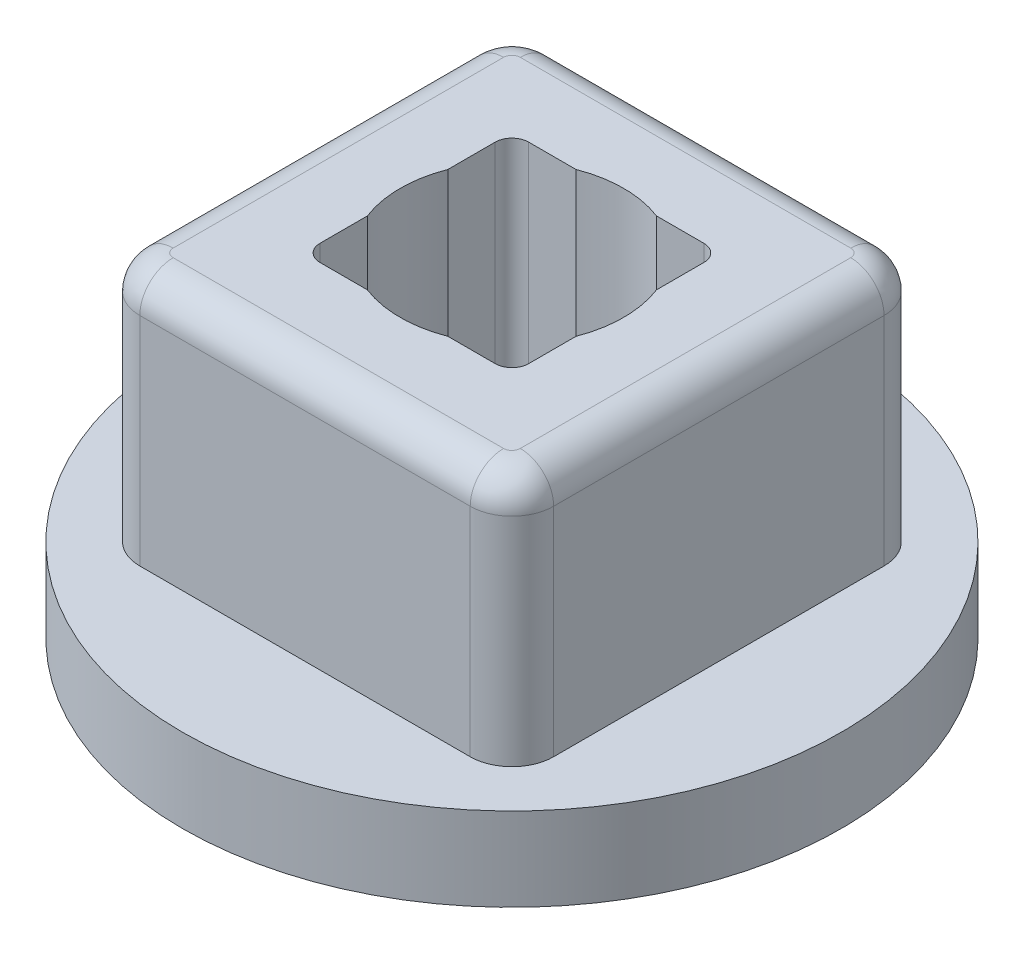
ISO-10303-21;
HEADER;
FILE_DESCRIPTION(('STEP AP214'),'2;1');
FILE_NAME('part.step','',(''),(''),'','','');
FILE_SCHEMA(('AUTOMOTIVE_DESIGN { 1 0 10303 214 1 1 1 1 }'));
ENDSEC;
DATA;
#1=APPLICATION_CONTEXT('core data for automotive mechanical design processes');
#2=APPLICATION_PROTOCOL_DEFINITION('international standard','automotive_design',2000,#1);
#3=PRODUCT_CONTEXT('',#1,'mechanical');
#4=PRODUCT('Part','Part','',(#3));
#5=PRODUCT_RELATED_PRODUCT_CATEGORY('part','',(#4));
#6=PRODUCT_DEFINITION_FORMATION('','',#4);
#7=PRODUCT_DEFINITION_CONTEXT('part definition',#1,'design');
#8=PRODUCT_DEFINITION('design','',#6,#7);
#9=PRODUCT_DEFINITION_SHAPE('','',#8);
#10=(LENGTH_UNIT() NAMED_UNIT(*) SI_UNIT(.MILLI.,.METRE.));
#11=(NAMED_UNIT(*) PLANE_ANGLE_UNIT() SI_UNIT($,.RADIAN.));
#12=(NAMED_UNIT(*) SI_UNIT($,.STERADIAN.) SOLID_ANGLE_UNIT());
#13=UNCERTAINTY_MEASURE_WITH_UNIT(LENGTH_MEASURE(1.E-05),#10,'distance_accuracy_value','');
#14=(GEOMETRIC_REPRESENTATION_CONTEXT(3) GLOBAL_UNCERTAINTY_ASSIGNED_CONTEXT((#13)) GLOBAL_UNIT_ASSIGNED_CONTEXT((#10,
#11,#12)) REPRESENTATION_CONTEXT('',''));
#15=CARTESIAN_POINT('',(0.,0.,0.));
#16=DIRECTION('',(0.,0.,1.));
#17=DIRECTION('',(1.,0.,0.));
#18=AXIS2_PLACEMENT_3D('',#15,#16,#17);
#19=CARTESIAN_POINT('',(-1.5875,5.08,-1.5875));
#20=DIRECTION('',(-1.,0.,0.));
#21=DIRECTION('',(0.,0.,-1.));
#22=AXIS2_PLACEMENT_3D('',#19,#20,#21);
#23=PLANE('',#22);
#24=DIRECTION('',(0.,0.,1.));
#25=VECTOR('',#24,1.);
#26=CARTESIAN_POINT('',(-1.5875,0.,-1.5875));
#27=LINE('',#26,#25);
#28=CARTESIAN_POINT('',(-1.5875,0.,-1.3335));
#29=VERTEX_POINT('',#28);
#30=CARTESIAN_POINT('',(-1.5875,0.,-0.613161471392323));
#31=VERTEX_POINT('',#30);
#32=EDGE_CURVE('E257',#29,#31,#27,.T.);
#33=ORIENTED_EDGE('',*,*,#32,.F.);
#34=DIRECTION('',(0.,-1.,0.));
#35=VECTOR('',#34,1.);
#36=CARTESIAN_POINT('',(-1.5875,0.,-1.3335));
#37=LINE('',#36,#35);
#38=CARTESIAN_POINT('',(-1.5875,5.08,-1.3335));
#39=VERTEX_POINT('',#38);
#40=EDGE_CURVE('E321',#39,#29,#37,.T.);
#41=ORIENTED_EDGE('',*,*,#40,.F.);
#42=DIRECTION('',(0.,0.,1.));
#43=VECTOR('',#42,1.);
#44=CARTESIAN_POINT('',(-1.5875,5.08,-1.5875));
#45=LINE('',#44,#43);
#46=CARTESIAN_POINT('',(-1.5875,5.08,-0.613161471392323));
#47=VERTEX_POINT('',#46);
#48=EDGE_CURVE('E455',#39,#47,#45,.T.);
#49=ORIENTED_EDGE('',*,*,#48,.T.);
#50=DIRECTION('',(0.,1.,0.));
#51=VECTOR('',#50,1.);
#52=CARTESIAN_POINT('',(-1.5875,-45.974,-0.613161471392323));
#53=LINE('',#52,#51);
#54=EDGE_CURVE('E408',#31,#47,#53,.T.);
#55=ORIENTED_EDGE('',*,*,#54,.F.);
#56=EDGE_LOOP('',(#33,#41,#49,#55));
#57=FACE_BOUND('',#56,.T.);
#58=ADVANCED_FACE('F37',(#57),#23,.F.);
#59=CARTESIAN_POINT('',(1.5875,5.08,-1.5875));
#60=DIRECTION('',(0.,0.,-1.));
#61=DIRECTION('',(1.,0.,0.));
#62=AXIS2_PLACEMENT_3D('',#59,#60,#61);
#63=PLANE('',#62);
#64=DIRECTION('',(-1.,0.,0.));
#65=VECTOR('',#64,1.);
#66=CARTESIAN_POINT('',(1.5875,0.,-1.5875));
#67=LINE('',#66,#65);
#68=CARTESIAN_POINT('',(1.3335,0.,-1.5875));
#69=VERTEX_POINT('',#68);
#70=CARTESIAN_POINT('',(0.613161471392323,0.,-1.5875));
#71=VERTEX_POINT('',#70);
#72=EDGE_CURVE('E270',#69,#71,#67,.T.);
#73=ORIENTED_EDGE('',*,*,#72,.F.);
#74=DIRECTION('',(0.,-1.,0.));
#75=VECTOR('',#74,1.);
#76=CARTESIAN_POINT('',(1.3335,0.,-1.5875));
#77=LINE('',#76,#75);
#78=CARTESIAN_POINT('',(1.3335,5.08,-1.5875));
#79=VERTEX_POINT('',#78);
#80=EDGE_CURVE('E247',#79,#69,#77,.T.);
#81=ORIENTED_EDGE('',*,*,#80,.F.);
#82=DIRECTION('',(-1.,0.,0.));
#83=VECTOR('',#82,1.);
#84=CARTESIAN_POINT('',(1.5875,5.08,-1.5875));
#85=LINE('',#84,#83);
#86=CARTESIAN_POINT('',(0.613161471392323,5.08,-1.5875));
#87=VERTEX_POINT('',#86);
#88=EDGE_CURVE('E228',#79,#87,#85,.T.);
#89=ORIENTED_EDGE('',*,*,#88,.T.);
#90=DIRECTION('',(0.,1.,0.));
#91=VECTOR('',#90,1.);
#92=CARTESIAN_POINT('',(0.613161471392323,-45.974,-1.5875));
#93=LINE('',#92,#91);
#94=EDGE_CURVE('E237',#71,#87,#93,.T.);
#95=ORIENTED_EDGE('',*,*,#94,.F.);
#96=EDGE_LOOP('',(#73,#81,#89,#95));
#97=FACE_BOUND('',#96,.T.);
#98=ADVANCED_FACE('F245',(#97),#63,.F.);
#99=CARTESIAN_POINT('',(1.5875,5.08,1.5875));
#100=DIRECTION('',(1.,0.,0.));
#101=DIRECTION('',(0.,0.,1.));
#102=AXIS2_PLACEMENT_3D('',#99,#100,#101);
#103=PLANE('',#102);
#104=DIRECTION('',(0.,0.,-1.));
#105=VECTOR('',#104,1.);
#106=CARTESIAN_POINT('',(1.5875,0.,1.5875));
#107=LINE('',#106,#105);
#108=CARTESIAN_POINT('',(1.5875,0.,1.3335));
#109=VERTEX_POINT('',#108);
#110=CARTESIAN_POINT('',(1.5875,0.,0.613161471392323));
#111=VERTEX_POINT('',#110);
#112=EDGE_CURVE('E266',#109,#111,#107,.T.);
#113=ORIENTED_EDGE('',*,*,#112,.F.);
#114=DIRECTION('',(0.,-1.,0.));
#115=VECTOR('',#114,1.);
#116=CARTESIAN_POINT('',(1.5875,0.,1.3335));
#117=LINE('',#116,#115);
#118=CARTESIAN_POINT('',(1.5875,5.08,1.3335));
#119=VERTEX_POINT('',#118);
#120=EDGE_CURVE('E334',#119,#109,#117,.T.);
#121=ORIENTED_EDGE('',*,*,#120,.F.);
#122=DIRECTION('',(0.,0.,-1.));
#123=VECTOR('',#122,1.);
#124=CARTESIAN_POINT('',(1.5875,5.08,1.5875));
#125=LINE('',#124,#123);
#126=CARTESIAN_POINT('',(1.5875,5.08,0.613161471392323));
#127=VERTEX_POINT('',#126);
#128=EDGE_CURVE('E253',#119,#127,#125,.T.);
#129=ORIENTED_EDGE('',*,*,#128,.T.);
#130=DIRECTION('',(0.,1.,0.));
#131=VECTOR('',#130,1.);
#132=CARTESIAN_POINT('',(1.5875,-45.974,0.613161471392323));
#133=LINE('',#132,#131);
#134=EDGE_CURVE('E445',#111,#127,#133,.T.);
#135=ORIENTED_EDGE('',*,*,#134,.F.);
#136=EDGE_LOOP('',(#113,#121,#129,#135));
#137=FACE_BOUND('',#136,.T.);
#138=ADVANCED_FACE('F473',(#137),#103,.F.);
#139=CARTESIAN_POINT('',(-1.5875,5.08,1.5875));
#140=DIRECTION('',(0.,0.,1.));
#141=DIRECTION('',(-1.,0.,0.));
#142=AXIS2_PLACEMENT_3D('',#139,#140,#141);
#143=PLANE('',#142);
#144=DIRECTION('',(1.,0.,0.));
#145=VECTOR('',#144,1.);
#146=CARTESIAN_POINT('',(-1.5875,0.,1.5875));
#147=LINE('',#146,#145);
#148=CARTESIAN_POINT('',(-1.3335,0.,1.5875));
#149=VERTEX_POINT('',#148);
#150=CARTESIAN_POINT('',(-0.613161471392323,0.,1.5875));
#151=VERTEX_POINT('',#150);
#152=EDGE_CURVE('E262',#149,#151,#147,.T.);
#153=ORIENTED_EDGE('',*,*,#152,.F.);
#154=DIRECTION('',(0.,-1.,0.));
#155=VECTOR('',#154,1.);
#156=CARTESIAN_POINT('',(-1.3335,0.,1.5875));
#157=LINE('',#156,#155);
#158=CARTESIAN_POINT('',(-1.3335,5.08,1.5875));
#159=VERTEX_POINT('',#158);
#160=EDGE_CURVE('E329',#159,#149,#157,.T.);
#161=ORIENTED_EDGE('',*,*,#160,.F.);
#162=DIRECTION('',(1.,0.,0.));
#163=VECTOR('',#162,1.);
#164=CARTESIAN_POINT('',(-1.5875,5.08,1.5875));
#165=LINE('',#164,#163);
#166=CARTESIAN_POINT('',(-0.613161471392323,5.08,1.5875));
#167=VERTEX_POINT('',#166);
#168=EDGE_CURVE('E458',#159,#167,#165,.T.);
#169=ORIENTED_EDGE('',*,*,#168,.T.);
#170=DIRECTION('',(0.,1.,0.));
#171=VECTOR('',#170,1.);
#172=CARTESIAN_POINT('',(-0.613161471392323,-45.974,1.5875));
#173=LINE('',#172,#171);
#174=EDGE_CURVE('E11',#151,#167,#173,.T.);
#175=ORIENTED_EDGE('',*,*,#174,.F.);
#176=EDGE_LOOP('',(#153,#161,#169,#175));
#177=FACE_BOUND('',#176,.T.);
#178=ADVANCED_FACE('F524',(#177),#143,.F.);
#179=CARTESIAN_POINT('',(5.0165,1.27,0.));
#180=DIRECTION('',(0.,1.,0.));
#181=DIRECTION('',(0.,0.,-1.));
#182=AXIS2_PLACEMENT_3D('',#179,#180,#181);
#183=PLANE('',#182);
#184=CARTESIAN_POINT('',(0.,1.27,0.));
#185=DIRECTION('',(0.,1.,0.));
#186=DIRECTION('',(0.,0.,1.));
#187=AXIS2_PLACEMENT_3D('',#184,#185,#186);
#188=CIRCLE('',#187,5.0165);
#189=CARTESIAN_POINT('',(0.,1.27,5.0165));
#190=VERTEX_POINT('',#189);
#191=EDGE_CURVE('E284',#190,#190,#188,.T.);
#192=ORIENTED_EDGE('',*,*,#191,.T.);
#193=EDGE_LOOP('',(#192));
#194=FACE_BOUND('',#193,.T.);
#195=DIRECTION('',(-1.,0.,0.));
#196=VECTOR('',#195,1.);
#197=CARTESIAN_POINT('',(-3.1496,1.27,3.1496));
#198=LINE('',#197,#196);
#199=CARTESIAN_POINT('',(2.5146,1.27,3.1496));
#200=VERTEX_POINT('',#199);
#201=CARTESIAN_POINT('',(-2.5146,1.27,3.1496));
#202=VERTEX_POINT('',#201);
#203=EDGE_CURVE('E251',#200,#202,#198,.T.);
#204=ORIENTED_EDGE('',*,*,#203,.T.);
#205=CARTESIAN_POINT('',(-2.5146,1.27,2.5146));
#206=DIRECTION('',(0.,-1.,0.));
#207=DIRECTION('',(0.,0.,-1.));
#208=AXIS2_PLACEMENT_3D('',#205,#206,#207);
#209=CIRCLE('',#208,0.635);
#210=CARTESIAN_POINT('',(-3.1496,1.27,2.5146));
#211=VERTEX_POINT('',#210);
#212=EDGE_CURVE('E313',#211,#202,#209,.F.);
#213=ORIENTED_EDGE('',*,*,#212,.F.);
#214=DIRECTION('',(0.,0.,-1.));
#215=VECTOR('',#214,1.);
#216=CARTESIAN_POINT('',(-3.1496,1.27,-3.1496));
#217=LINE('',#216,#215);
#218=CARTESIAN_POINT('',(-3.1496,1.27,-2.5146));
#219=VERTEX_POINT('',#218);
#220=EDGE_CURVE('E275',#211,#219,#217,.T.);
#221=ORIENTED_EDGE('',*,*,#220,.T.);
#222=CARTESIAN_POINT('',(-2.5146,1.27,-2.5146));
#223=DIRECTION('',(0.,-1.,0.));
#224=DIRECTION('',(0.,0.,-1.));
#225=AXIS2_PLACEMENT_3D('',#222,#223,#224);
#226=CIRCLE('',#225,0.635);
#227=CARTESIAN_POINT('',(-2.5146,1.27,-3.1496));
#228=VERTEX_POINT('',#227);
#229=EDGE_CURVE('E307',#228,#219,#226,.F.);
#230=ORIENTED_EDGE('',*,*,#229,.F.);
#231=DIRECTION('',(1.,0.,0.));
#232=VECTOR('',#231,1.);
#233=CARTESIAN_POINT('',(3.1496,1.27,-3.1496));
#234=LINE('',#233,#232);
#235=CARTESIAN_POINT('',(2.5146,1.27,-3.1496));
#236=VERTEX_POINT('',#235);
#237=EDGE_CURVE('E278',#228,#236,#234,.T.);
#238=ORIENTED_EDGE('',*,*,#237,.T.);
#239=CARTESIAN_POINT('',(2.5146,1.27,-2.5146));
#240=DIRECTION('',(0.,-1.,0.));
#241=DIRECTION('',(0.,0.,-1.));
#242=AXIS2_PLACEMENT_3D('',#239,#240,#241);
#243=CIRCLE('',#242,0.635);
#244=CARTESIAN_POINT('',(3.1496,1.27,-2.5146));
#245=VERTEX_POINT('',#244);
#246=EDGE_CURVE('E310',#245,#236,#243,.F.);
#247=ORIENTED_EDGE('',*,*,#246,.F.);
#248=DIRECTION('',(0.,0.,1.));
#249=VECTOR('',#248,1.);
#250=CARTESIAN_POINT('',(3.1496,1.27,3.1496));
#251=LINE('',#250,#249);
#252=CARTESIAN_POINT('',(3.1496,1.27,2.5146));
#253=VERTEX_POINT('',#252);
#254=EDGE_CURVE('E248',#245,#253,#251,.T.);
#255=ORIENTED_EDGE('',*,*,#254,.T.);
#256=CARTESIAN_POINT('',(2.5146,1.27,2.5146));
#257=DIRECTION('',(0.,-1.,0.));
#258=DIRECTION('',(0.,0.,-1.));
#259=AXIS2_PLACEMENT_3D('',#256,#257,#258);
#260=CIRCLE('',#259,0.635);
#261=EDGE_CURVE('E316',#200,#253,#260,.F.);
#262=ORIENTED_EDGE('',*,*,#261,.F.);
#263=EDGE_LOOP('',(#204,#213,#221,#230,#238,#247,#255,#262));
#264=FACE_BOUND('',#263,.T.);
#265=ADVANCED_FACE('F526',(#194,#264),#183,.T.);
#266=CARTESIAN_POINT('',(0.,1.27,0.));
#267=DIRECTION('',(0.,-1.,0.));
#268=DIRECTION('',(0.,0.,1.));
#269=AXIS2_PLACEMENT_3D('',#266,#267,#268);
#270=CYLINDRICAL_SURFACE('',#269,5.0165);
#271=ORIENTED_EDGE('',*,*,#191,.F.);
#272=EDGE_LOOP('',(#271));
#273=FACE_BOUND('',#272,.T.);
#274=CARTESIAN_POINT('',(0.,0.,0.));
#275=DIRECTION('',(0.,1.,0.));
#276=DIRECTION('',(0.,0.,1.));
#277=AXIS2_PLACEMENT_3D('',#274,#275,#276);
#278=CIRCLE('',#277,5.0165);
#279=CARTESIAN_POINT('',(0.,0.,5.0165));
#280=VERTEX_POINT('',#279);
#281=EDGE_CURVE('E281',#280,#280,#278,.T.);
#282=ORIENTED_EDGE('',*,*,#281,.T.);
#283=EDGE_LOOP('',(#282));
#284=FACE_BOUND('',#283,.T.);
#285=ADVANCED_FACE('F531',(#273,#284),#270,.T.);
#286=CARTESIAN_POINT('',(0.,0.,0.));
#287=DIRECTION('',(0.,-1.,0.));
#288=DIRECTION('',(0.,0.,1.));
#289=AXIS2_PLACEMENT_3D('',#286,#287,#288);
#290=PLANE('',#289);
#291=CARTESIAN_POINT('',(0.,0.,0.));
#292=DIRECTION('',(0.,1.,0.));
#293=DIRECTION('',(0.,0.,1.));
#294=AXIS2_PLACEMENT_3D('',#291,#292,#293);
#295=CIRCLE('',#294,1.7018);
#296=CARTESIAN_POINT('',(1.5875,0.,-0.613161471392323));
#297=VERTEX_POINT('',#296);
#298=EDGE_CURVE('E442',#111,#297,#295,.T.);
#299=ORIENTED_EDGE('',*,*,#298,.T.);
#300=CARTESIAN_POINT('',(1.5875,0.,-1.3335));
#301=VERTEX_POINT('',#300);
#302=EDGE_CURVE('E265',#297,#301,#107,.T.);
#303=ORIENTED_EDGE('',*,*,#302,.T.);
#304=CARTESIAN_POINT('',(1.3335,0.,-1.3335));
#305=DIRECTION('',(0.,1.,0.));
#306=DIRECTION('',(0.,0.,1.));
#307=AXIS2_PLACEMENT_3D('',#304,#305,#306);
#308=CIRCLE('',#307,0.254);
#309=EDGE_CURVE('E352',#69,#301,#308,.F.);
#310=ORIENTED_EDGE('',*,*,#309,.F.);
#311=ORIENTED_EDGE('',*,*,#72,.T.);
#312=CARTESIAN_POINT('',(-0.613161471392323,0.,-1.5875));
#313=VERTEX_POINT('',#312);
#314=EDGE_CURVE('E240',#71,#313,#295,.T.);
#315=ORIENTED_EDGE('',*,*,#314,.T.);
#316=CARTESIAN_POINT('',(-1.3335,0.,-1.5875));
#317=VERTEX_POINT('',#316);
#318=EDGE_CURVE('E269',#313,#317,#67,.T.);
#319=ORIENTED_EDGE('',*,*,#318,.T.);
#320=CARTESIAN_POINT('',(-1.3335,0.,-1.3335));
#321=DIRECTION('',(0.,1.,0.));
#322=DIRECTION('',(0.,0.,1.));
#323=AXIS2_PLACEMENT_3D('',#320,#321,#322);
#324=CIRCLE('',#323,0.254);
#325=EDGE_CURVE('E337',#29,#317,#324,.F.);
#326=ORIENTED_EDGE('',*,*,#325,.F.);
#327=ORIENTED_EDGE('',*,*,#32,.T.);
#328=CARTESIAN_POINT('',(-1.5875,0.,0.613161471392323));
#329=VERTEX_POINT('',#328);
#330=EDGE_CURVE('E441',#31,#329,#295,.T.);
#331=ORIENTED_EDGE('',*,*,#330,.T.);
#332=CARTESIAN_POINT('',(-1.5875,0.,1.3335));
#333=VERTEX_POINT('',#332);
#334=EDGE_CURVE('E261',#329,#333,#27,.T.);
#335=ORIENTED_EDGE('',*,*,#334,.T.);
#336=CARTESIAN_POINT('',(-1.3335,0.,1.3335));
#337=DIRECTION('',(0.,1.,0.));
#338=DIRECTION('',(0.,0.,1.));
#339=AXIS2_PLACEMENT_3D('',#336,#337,#338);
#340=CIRCLE('',#339,0.254);
#341=EDGE_CURVE('E342',#149,#333,#340,.F.);
#342=ORIENTED_EDGE('',*,*,#341,.F.);
#343=ORIENTED_EDGE('',*,*,#152,.T.);
#344=CARTESIAN_POINT('',(0.613161471392323,0.,1.5875));
#345=VERTEX_POINT('',#344);
#346=EDGE_CURVE('E426',#151,#345,#295,.T.);
#347=ORIENTED_EDGE('',*,*,#346,.T.);
#348=CARTESIAN_POINT('',(1.3335,0.,1.5875));
#349=VERTEX_POINT('',#348);
#350=EDGE_CURVE('E260',#345,#349,#147,.T.);
#351=ORIENTED_EDGE('',*,*,#350,.T.);
#352=CARTESIAN_POINT('',(1.3335,0.,1.3335));
#353=DIRECTION('',(0.,1.,0.));
#354=DIRECTION('',(0.,0.,1.));
#355=AXIS2_PLACEMENT_3D('',#352,#353,#354);
#356=CIRCLE('',#355,0.254);
#357=EDGE_CURVE('E347',#109,#349,#356,.F.);
#358=ORIENTED_EDGE('',*,*,#357,.F.);
#359=ORIENTED_EDGE('',*,*,#112,.T.);
#360=EDGE_LOOP('',(#299,#303,#310,#311,#315,#319,#326,#327,#331,#335,#342,#343,#347,#351,#358,#359));
#361=FACE_BOUND('',#360,.T.);
#362=ORIENTED_EDGE('',*,*,#281,.F.);
#363=EDGE_LOOP('',(#362));
#364=FACE_BOUND('',#363,.T.);
#365=ADVANCED_FACE('F436',(#361,#364),#290,.T.);
#366=CARTESIAN_POINT('',(3.1496,5.08,3.1496));
#367=DIRECTION('',(-1.,0.,0.));
#368=DIRECTION('',(0.,0.,-1.));
#369=AXIS2_PLACEMENT_3D('',#366,#367,#368);
#370=PLANE('',#369);
#371=DIRECTION('',(0.,-1.,0.));
#372=VECTOR('',#371,1.);
#373=CARTESIAN_POINT('',(3.1496,5.08,2.5146));
#374=LINE('',#373,#372);
#375=CARTESIAN_POINT('',(3.1496,4.572,2.5146));
#376=VERTEX_POINT('',#375);
#377=EDGE_CURVE('E297',#253,#376,#374,.F.);
#378=ORIENTED_EDGE('',*,*,#377,.F.);
#379=ORIENTED_EDGE('',*,*,#254,.F.);
#380=DIRECTION('',(0.,-1.,0.));
#381=VECTOR('',#380,1.);
#382=CARTESIAN_POINT('',(3.1496,5.08,-2.5146));
#383=LINE('',#382,#381);
#384=CARTESIAN_POINT('',(3.1496,4.572,-2.5146));
#385=VERTEX_POINT('',#384);
#386=EDGE_CURVE('E300',#385,#245,#383,.T.);
#387=ORIENTED_EDGE('',*,*,#386,.F.);
#388=DIRECTION('',(0.,0.,1.));
#389=VECTOR('',#388,1.);
#390=CARTESIAN_POINT('',(3.1496,4.572,3.1496));
#391=LINE('',#390,#389);
#392=EDGE_CURVE('E402',#376,#385,#391,.F.);
#393=ORIENTED_EDGE('',*,*,#392,.F.);
#394=EDGE_LOOP('',(#378,#379,#387,#393));
#395=FACE_BOUND('',#394,.T.);
#396=ADVANCED_FACE('F599',(#395),#370,.F.);
#397=CARTESIAN_POINT('',(-3.1496,5.08,3.1496));
#398=DIRECTION('',(0.,0.,-1.));
#399=DIRECTION('',(1.,0.,0.));
#400=AXIS2_PLACEMENT_3D('',#397,#398,#399);
#401=PLANE('',#400);
#402=DIRECTION('',(0.,-1.,0.));
#403=VECTOR('',#402,1.);
#404=CARTESIAN_POINT('',(-2.5146,5.08,3.1496));
#405=LINE('',#404,#403);
#406=CARTESIAN_POINT('',(-2.5146,4.572,3.1496));
#407=VERTEX_POINT('',#406);
#408=EDGE_CURVE('E304',#202,#407,#405,.F.);
#409=ORIENTED_EDGE('',*,*,#408,.F.);
#410=ORIENTED_EDGE('',*,*,#203,.F.);
#411=DIRECTION('',(0.,-1.,0.));
#412=VECTOR('',#411,1.);
#413=CARTESIAN_POINT('',(2.5146,5.08,3.1496));
#414=LINE('',#413,#412);
#415=CARTESIAN_POINT('',(2.5146,4.572,3.1496));
#416=VERTEX_POINT('',#415);
#417=EDGE_CURVE('E302',#416,#200,#414,.T.);
#418=ORIENTED_EDGE('',*,*,#417,.F.);
#419=DIRECTION('',(-1.,0.,0.));
#420=VECTOR('',#419,1.);
#421=CARTESIAN_POINT('',(-3.1496,4.572,3.1496));
#422=LINE('',#421,#420);
#423=EDGE_CURVE('E393',#407,#416,#422,.F.);
#424=ORIENTED_EDGE('',*,*,#423,.F.);
#425=EDGE_LOOP('',(#409,#410,#418,#424));
#426=FACE_BOUND('',#425,.T.);
#427=ADVANCED_FACE('F620',(#426),#401,.F.);
#428=CARTESIAN_POINT('',(-3.1496,5.08,-3.1496));
#429=DIRECTION('',(1.,0.,0.));
#430=DIRECTION('',(0.,0.,1.));
#431=AXIS2_PLACEMENT_3D('',#428,#429,#430);
#432=PLANE('',#431);
#433=DIRECTION('',(0.,-1.,0.));
#434=VECTOR('',#433,1.);
#435=CARTESIAN_POINT('',(-3.1496,5.08,-2.5146));
#436=LINE('',#435,#434);
#437=CARTESIAN_POINT('',(-3.1496,4.572,-2.5146));
#438=VERTEX_POINT('',#437);
#439=EDGE_CURVE('E294',#219,#438,#436,.F.);
#440=ORIENTED_EDGE('',*,*,#439,.F.);
#441=ORIENTED_EDGE('',*,*,#220,.F.);
#442=DIRECTION('',(0.,-1.,0.));
#443=VECTOR('',#442,1.);
#444=CARTESIAN_POINT('',(-3.1496,5.08,2.5146));
#445=LINE('',#444,#443);
#446=CARTESIAN_POINT('',(-3.1496,4.572,2.5146));
#447=VERTEX_POINT('',#446);
#448=EDGE_CURVE('E292',#447,#211,#445,.T.);
#449=ORIENTED_EDGE('',*,*,#448,.F.);
#450=DIRECTION('',(0.,0.,-1.));
#451=VECTOR('',#450,1.);
#452=CARTESIAN_POINT('',(-3.1496,4.572,-3.1496));
#453=LINE('',#452,#451);
#454=EDGE_CURVE('E381',#438,#447,#453,.F.);
#455=ORIENTED_EDGE('',*,*,#454,.F.);
#456=EDGE_LOOP('',(#440,#441,#449,#455));
#457=FACE_BOUND('',#456,.T.);
#458=ADVANCED_FACE('F624',(#457),#432,.F.);
#459=CARTESIAN_POINT('',(3.1496,5.08,-3.1496));
#460=DIRECTION('',(0.,0.,1.));
#461=DIRECTION('',(-1.,0.,0.));
#462=AXIS2_PLACEMENT_3D('',#459,#460,#461);
#463=PLANE('',#462);
#464=DIRECTION('',(0.,-1.,0.));
#465=VECTOR('',#464,1.);
#466=CARTESIAN_POINT('',(2.5146,5.08,-3.1496));
#467=LINE('',#466,#465);
#468=CARTESIAN_POINT('',(2.5146,4.572,-3.1496));
#469=VERTEX_POINT('',#468);
#470=EDGE_CURVE('E287',#236,#469,#467,.F.);
#471=ORIENTED_EDGE('',*,*,#470,.F.);
#472=ORIENTED_EDGE('',*,*,#237,.F.);
#473=DIRECTION('',(0.,-1.,0.));
#474=VECTOR('',#473,1.);
#475=CARTESIAN_POINT('',(-2.5146,5.08,-3.1496));
#476=LINE('',#475,#474);
#477=CARTESIAN_POINT('',(-2.5146,4.572,-3.1496));
#478=VERTEX_POINT('',#477);
#479=EDGE_CURVE('E290',#478,#228,#476,.T.);
#480=ORIENTED_EDGE('',*,*,#479,.F.);
#481=DIRECTION('',(1.,0.,0.));
#482=VECTOR('',#481,1.);
#483=CARTESIAN_POINT('',(3.1496,4.572,-3.1496));
#484=LINE('',#483,#482);
#485=EDGE_CURVE('E390',#469,#478,#484,.F.);
#486=ORIENTED_EDGE('',*,*,#485,.F.);
#487=EDGE_LOOP('',(#471,#472,#480,#486));
#488=FACE_BOUND('',#487,.T.);
#489=ADVANCED_FACE('F513',(#488),#463,.F.);
#490=CARTESIAN_POINT('',(0.,5.08,0.));
#491=DIRECTION('',(0.,-1.,0.));
#492=DIRECTION('',(0.,0.,1.));
#493=AXIS2_PLACEMENT_3D('',#490,#491,#492);
#494=PLANE('',#493);
#495=CARTESIAN_POINT('',(-2.5146,5.08,2.5146));
#496=DIRECTION('',(0.,1.,0.));
#497=DIRECTION('',(0.,0.,1.));
#498=AXIS2_PLACEMENT_3D('',#495,#496,#497);
#499=CIRCLE('',#498,0.127);
#500=CARTESIAN_POINT('',(-2.5146,5.08,2.6416));
#501=VERTEX_POINT('',#500);
#502=CARTESIAN_POINT('',(-2.6416,5.08,2.5146));
#503=VERTEX_POINT('',#502);
#504=EDGE_CURVE('E372',#501,#503,#499,.F.);
#505=ORIENTED_EDGE('',*,*,#504,.F.);
#506=DIRECTION('',(-1.,0.,0.));
#507=VECTOR('',#506,1.);
#508=CARTESIAN_POINT('',(0.,5.08,2.6416));
#509=LINE('',#508,#507);
#510=CARTESIAN_POINT('',(2.5146,5.08,2.6416));
#511=VERTEX_POINT('',#510);
#512=EDGE_CURVE('E366',#511,#501,#509,.T.);
#513=ORIENTED_EDGE('',*,*,#512,.F.);
#514=CARTESIAN_POINT('',(2.5146,5.08,2.5146));
#515=DIRECTION('',(0.,1.,0.));
#516=DIRECTION('',(0.,0.,1.));
#517=AXIS2_PLACEMENT_3D('',#514,#515,#516);
#518=CIRCLE('',#517,0.127);
#519=CARTESIAN_POINT('',(2.6416,5.08,2.5146));
#520=VERTEX_POINT('',#519);
#521=EDGE_CURVE('E360',#520,#511,#518,.F.);
#522=ORIENTED_EDGE('',*,*,#521,.F.);
#523=DIRECTION('',(0.,0.,1.));
#524=VECTOR('',#523,1.);
#525=CARTESIAN_POINT('',(2.6416,5.08,0.));
#526=LINE('',#525,#524);
#527=CARTESIAN_POINT('',(2.6416,5.08,-2.5146));
#528=VERTEX_POINT('',#527);
#529=EDGE_CURVE('E357',#528,#520,#526,.T.);
#530=ORIENTED_EDGE('',*,*,#529,.F.);
#531=CARTESIAN_POINT('',(2.5146,5.08,-2.5146));
#532=DIRECTION('',(0.,1.,0.));
#533=DIRECTION('',(0.,0.,1.));
#534=AXIS2_PLACEMENT_3D('',#531,#532,#533);
#535=CIRCLE('',#534,0.127);
#536=CARTESIAN_POINT('',(2.5146,5.08,-2.6416));
#537=VERTEX_POINT('',#536);
#538=EDGE_CURVE('E363',#537,#528,#535,.F.);
#539=ORIENTED_EDGE('',*,*,#538,.F.);
#540=DIRECTION('',(1.,0.,0.));
#541=VECTOR('',#540,1.);
#542=CARTESIAN_POINT('',(0.,5.08,-2.6416));
#543=LINE('',#542,#541);
#544=CARTESIAN_POINT('',(-2.5146,5.08,-2.6416));
#545=VERTEX_POINT('',#544);
#546=EDGE_CURVE('E369',#545,#537,#543,.T.);
#547=ORIENTED_EDGE('',*,*,#546,.F.);
#548=CARTESIAN_POINT('',(-2.5146,5.08,-2.5146));
#549=DIRECTION('',(0.,1.,0.));
#550=DIRECTION('',(0.,0.,1.));
#551=AXIS2_PLACEMENT_3D('',#548,#549,#550);
#552=CIRCLE('',#551,0.127);
#553=CARTESIAN_POINT('',(-2.6416,5.08,-2.5146));
#554=VERTEX_POINT('',#553);
#555=EDGE_CURVE('E375',#554,#545,#552,.F.);
#556=ORIENTED_EDGE('',*,*,#555,.F.);
#557=DIRECTION('',(0.,0.,-1.));
#558=VECTOR('',#557,1.);
#559=CARTESIAN_POINT('',(-2.6416,5.08,0.));
#560=LINE('',#559,#558);
#561=EDGE_CURVE('E378',#503,#554,#560,.T.);
#562=ORIENTED_EDGE('',*,*,#561,.F.);
#563=EDGE_LOOP('',(#505,#513,#522,#530,#539,#547,#556,#562));
#564=FACE_BOUND('',#563,.T.);
#565=ORIENTED_EDGE('',*,*,#128,.F.);
#566=CARTESIAN_POINT('',(1.3335,5.08,1.3335));
#567=DIRECTION('',(0.,1.,0.));
#568=DIRECTION('',(0.,0.,1.));
#569=AXIS2_PLACEMENT_3D('',#566,#567,#568);
#570=CIRCLE('',#569,0.254);
#571=CARTESIAN_POINT('',(1.3335,5.08,1.5875));
#572=VERTEX_POINT('',#571);
#573=EDGE_CURVE('E350',#572,#119,#570,.T.);
#574=ORIENTED_EDGE('',*,*,#573,.F.);
#575=CARTESIAN_POINT('',(0.613161471392323,5.08,1.5875));
#576=VERTEX_POINT('',#575);
#577=EDGE_CURVE('E457',#576,#572,#165,.T.);
#578=ORIENTED_EDGE('',*,*,#577,.F.);
#579=CARTESIAN_POINT('',(0.,5.08,0.));
#580=DIRECTION('',(0.,-1.,0.));
#581=DIRECTION('',(0.,0.,-1.));
#582=AXIS2_PLACEMENT_3D('',#579,#580,#581);
#583=CIRCLE('',#582,1.7018);
#584=EDGE_CURVE('E428',#576,#167,#583,.T.);
#585=ORIENTED_EDGE('',*,*,#584,.T.);
#586=ORIENTED_EDGE('',*,*,#168,.F.);
#587=CARTESIAN_POINT('',(-1.3335,5.08,1.3335));
#588=DIRECTION('',(0.,1.,0.));
#589=DIRECTION('',(0.,0.,1.));
#590=AXIS2_PLACEMENT_3D('',#587,#588,#589);
#591=CIRCLE('',#590,0.254);
#592=CARTESIAN_POINT('',(-1.5875,5.08,1.3335));
#593=VERTEX_POINT('',#592);
#594=EDGE_CURVE('E345',#593,#159,#591,.T.);
#595=ORIENTED_EDGE('',*,*,#594,.F.);
#596=CARTESIAN_POINT('',(-1.5875,5.08,0.613161471392323));
#597=VERTEX_POINT('',#596);
#598=EDGE_CURVE('E271',#597,#593,#45,.T.);
#599=ORIENTED_EDGE('',*,*,#598,.F.);
#600=EDGE_CURVE('E233',#597,#47,#583,.T.);
#601=ORIENTED_EDGE('',*,*,#600,.T.);
#602=ORIENTED_EDGE('',*,*,#48,.F.);
#603=CARTESIAN_POINT('',(-1.3335,5.08,-1.3335));
#604=DIRECTION('',(0.,1.,0.));
#605=DIRECTION('',(0.,0.,1.));
#606=AXIS2_PLACEMENT_3D('',#603,#604,#605);
#607=CIRCLE('',#606,0.254);
#608=CARTESIAN_POINT('',(-1.3335,5.08,-1.5875));
#609=VERTEX_POINT('',#608);
#610=EDGE_CURVE('E340',#609,#39,#607,.T.);
#611=ORIENTED_EDGE('',*,*,#610,.F.);
#612=CARTESIAN_POINT('',(-0.613161471392323,5.08,-1.5875));
#613=VERTEX_POINT('',#612);
#614=EDGE_CURVE('E232',#613,#609,#85,.T.);
#615=ORIENTED_EDGE('',*,*,#614,.F.);
#616=EDGE_CURVE('E222',#613,#87,#583,.T.);
#617=ORIENTED_EDGE('',*,*,#616,.T.);
#618=ORIENTED_EDGE('',*,*,#88,.F.);
#619=CARTESIAN_POINT('',(1.3335,5.08,-1.3335));
#620=DIRECTION('',(0.,1.,0.));
#621=DIRECTION('',(0.,0.,1.));
#622=AXIS2_PLACEMENT_3D('',#619,#620,#621);
#623=CIRCLE('',#622,0.254);
#624=CARTESIAN_POINT('',(1.5875,5.08,-1.3335));
#625=VERTEX_POINT('',#624);
#626=EDGE_CURVE('E355',#625,#79,#623,.T.);
#627=ORIENTED_EDGE('',*,*,#626,.F.);
#628=CARTESIAN_POINT('',(1.5875,5.08,-0.613161471392323));
#629=VERTEX_POINT('',#628);
#630=EDGE_CURVE('E460',#629,#625,#125,.T.);
#631=ORIENTED_EDGE('',*,*,#630,.F.);
#632=EDGE_CURVE('E235',#629,#127,#583,.T.);
#633=ORIENTED_EDGE('',*,*,#632,.T.);
#634=EDGE_LOOP('',(#565,#574,#578,#585,#586,#595,#599,#601,#602,#611,#615,#617,#618,#627,#631,#633));
#635=FACE_BOUND('',#634,.T.);
#636=ADVANCED_FACE('F225',(#564,#635),#494,.F.);
#637=ORIENTED_EDGE('',*,*,#598,.T.);
#638=DIRECTION('',(0.,-1.,0.));
#639=VECTOR('',#638,1.);
#640=CARTESIAN_POINT('',(-1.5875,5.08,1.3335));
#641=LINE('',#640,#639);
#642=EDGE_CURVE('E319',#333,#593,#641,.F.);
#643=ORIENTED_EDGE('',*,*,#642,.F.);
#644=ORIENTED_EDGE('',*,*,#334,.F.);
#645=DIRECTION('',(0.,1.,0.));
#646=VECTOR('',#645,1.);
#647=CARTESIAN_POINT('',(-1.5875,-45.974,0.613161471392323));
#648=LINE('',#647,#646);
#649=EDGE_CURVE('E52',#597,#329,#648,.F.);
#650=ORIENTED_EDGE('',*,*,#649,.F.);
#651=EDGE_LOOP('',(#637,#643,#644,#650));
#652=FACE_BOUND('',#651,.T.);
#653=ADVANCED_FACE('F497',(#652),#23,.F.);
#654=ORIENTED_EDGE('',*,*,#614,.T.);
#655=DIRECTION('',(0.,-1.,0.));
#656=VECTOR('',#655,1.);
#657=CARTESIAN_POINT('',(-1.3335,5.08,-1.5875));
#658=LINE('',#657,#656);
#659=EDGE_CURVE('E325',#317,#609,#658,.F.);
#660=ORIENTED_EDGE('',*,*,#659,.F.);
#661=ORIENTED_EDGE('',*,*,#318,.F.);
#662=DIRECTION('',(0.,1.,0.));
#663=VECTOR('',#662,1.);
#664=CARTESIAN_POINT('',(-0.613161471392323,-45.974,-1.5875));
#665=LINE('',#664,#663);
#666=EDGE_CURVE('E60',#613,#313,#665,.F.);
#667=ORIENTED_EDGE('',*,*,#666,.F.);
#668=EDGE_LOOP('',(#654,#660,#661,#667));
#669=FACE_BOUND('',#668,.T.);
#670=ADVANCED_FACE('F502',(#669),#63,.F.);
#671=ORIENTED_EDGE('',*,*,#630,.T.);
#672=DIRECTION('',(0.,-1.,0.));
#673=VECTOR('',#672,1.);
#674=CARTESIAN_POINT('',(1.5875,5.08,-1.3335));
#675=LINE('',#674,#673);
#676=EDGE_CURVE('E332',#301,#625,#675,.F.);
#677=ORIENTED_EDGE('',*,*,#676,.F.);
#678=ORIENTED_EDGE('',*,*,#302,.F.);
#679=DIRECTION('',(0.,1.,0.));
#680=VECTOR('',#679,1.);
#681=CARTESIAN_POINT('',(1.5875,-45.974,-0.613161471392323));
#682=LINE('',#681,#680);
#683=EDGE_CURVE('E439',#629,#297,#682,.F.);
#684=ORIENTED_EDGE('',*,*,#683,.F.);
#685=EDGE_LOOP('',(#671,#677,#678,#684));
#686=FACE_BOUND('',#685,.T.);
#687=ADVANCED_FACE('F480',(#686),#103,.F.);
#688=ORIENTED_EDGE('',*,*,#577,.T.);
#689=DIRECTION('',(0.,-1.,0.));
#690=VECTOR('',#689,1.);
#691=CARTESIAN_POINT('',(1.3335,5.08,1.5875));
#692=LINE('',#691,#690);
#693=EDGE_CURVE('E327',#349,#572,#692,.F.);
#694=ORIENTED_EDGE('',*,*,#693,.F.);
#695=ORIENTED_EDGE('',*,*,#350,.F.);
#696=DIRECTION('',(0.,1.,0.));
#697=VECTOR('',#696,1.);
#698=CARTESIAN_POINT('',(0.613161471392323,-45.974,1.5875));
#699=LINE('',#698,#697);
#700=EDGE_CURVE('E45',#576,#345,#699,.F.);
#701=ORIENTED_EDGE('',*,*,#700,.F.);
#702=EDGE_LOOP('',(#688,#694,#695,#701));
#703=FACE_BOUND('',#702,.T.);
#704=ADVANCED_FACE('F433',(#703),#143,.F.);
#705=CARTESIAN_POINT('',(-2.5146,5.08,-2.5146));
#706=DIRECTION('',(0.,-1.,0.));
#707=DIRECTION('',(0.,0.,1.));
#708=AXIS2_PLACEMENT_3D('',#705,#706,#707);
#709=CYLINDRICAL_SURFACE('',#708,0.635);
#710=ORIENTED_EDGE('',*,*,#479,.T.);
#711=ORIENTED_EDGE('',*,*,#229,.T.);
#712=ORIENTED_EDGE('',*,*,#439,.T.);
#713=CARTESIAN_POINT('',(-2.5146,4.572,-2.5146));
#714=DIRECTION('',(0.,1.,0.));
#715=DIRECTION('',(0.,0.,1.));
#716=AXIS2_PLACEMENT_3D('',#713,#714,#715);
#717=CIRCLE('',#716,0.635);
#718=EDGE_CURVE('E384',#478,#438,#717,.T.);
#719=ORIENTED_EDGE('',*,*,#718,.F.);
#720=EDGE_LOOP('',(#710,#711,#712,#719));
#721=FACE_BOUND('',#720,.T.);
#722=ADVANCED_FACE('F536',(#721),#709,.T.);
#723=CARTESIAN_POINT('',(2.5146,5.08,-2.5146));
#724=DIRECTION('',(0.,-1.,0.));
#725=DIRECTION('',(0.,0.,1.));
#726=AXIS2_PLACEMENT_3D('',#723,#724,#725);
#727=CYLINDRICAL_SURFACE('',#726,0.635);
#728=ORIENTED_EDGE('',*,*,#386,.T.);
#729=ORIENTED_EDGE('',*,*,#246,.T.);
#730=ORIENTED_EDGE('',*,*,#470,.T.);
#731=CARTESIAN_POINT('',(2.5146,4.572,-2.5146));
#732=DIRECTION('',(0.,1.,0.));
#733=DIRECTION('',(0.,0.,1.));
#734=AXIS2_PLACEMENT_3D('',#731,#732,#733);
#735=CIRCLE('',#734,0.635);
#736=EDGE_CURVE('E396',#385,#469,#735,.T.);
#737=ORIENTED_EDGE('',*,*,#736,.F.);
#738=EDGE_LOOP('',(#728,#729,#730,#737));
#739=FACE_BOUND('',#738,.T.);
#740=ADVANCED_FACE('F541',(#739),#727,.T.);
#741=CARTESIAN_POINT('',(-2.5146,5.08,2.5146));
#742=DIRECTION('',(0.,-1.,0.));
#743=DIRECTION('',(0.,0.,1.));
#744=AXIS2_PLACEMENT_3D('',#741,#742,#743);
#745=CYLINDRICAL_SURFACE('',#744,0.635);
#746=ORIENTED_EDGE('',*,*,#448,.T.);
#747=ORIENTED_EDGE('',*,*,#212,.T.);
#748=ORIENTED_EDGE('',*,*,#408,.T.);
#749=CARTESIAN_POINT('',(-2.5146,4.572,2.5146));
#750=DIRECTION('',(0.,1.,0.));
#751=DIRECTION('',(0.,0.,1.));
#752=AXIS2_PLACEMENT_3D('',#749,#750,#751);
#753=CIRCLE('',#752,0.635);
#754=EDGE_CURVE('E387',#447,#407,#753,.T.);
#755=ORIENTED_EDGE('',*,*,#754,.F.);
#756=EDGE_LOOP('',(#746,#747,#748,#755));
#757=FACE_BOUND('',#756,.T.);
#758=ADVANCED_FACE('F615',(#757),#745,.T.);
#759=CARTESIAN_POINT('',(2.5146,5.08,2.5146));
#760=DIRECTION('',(0.,-1.,0.));
#761=DIRECTION('',(0.,0.,1.));
#762=AXIS2_PLACEMENT_3D('',#759,#760,#761);
#763=CYLINDRICAL_SURFACE('',#762,0.635);
#764=ORIENTED_EDGE('',*,*,#417,.T.);
#765=ORIENTED_EDGE('',*,*,#261,.T.);
#766=ORIENTED_EDGE('',*,*,#377,.T.);
#767=CARTESIAN_POINT('',(2.5146,4.572,2.5146));
#768=DIRECTION('',(0.,1.,0.));
#769=DIRECTION('',(0.,0.,1.));
#770=AXIS2_PLACEMENT_3D('',#767,#768,#769);
#771=CIRCLE('',#770,0.635);
#772=EDGE_CURVE('E399',#416,#376,#771,.T.);
#773=ORIENTED_EDGE('',*,*,#772,.F.);
#774=EDGE_LOOP('',(#764,#765,#766,#773));
#775=FACE_BOUND('',#774,.T.);
#776=ADVANCED_FACE('F595',(#775),#763,.T.);
#777=CARTESIAN_POINT('',(-1.3335,5.08,-1.3335));
#778=DIRECTION('',(0.,1.,0.));
#779=DIRECTION('',(0.,0.,-1.));
#780=AXIS2_PLACEMENT_3D('',#777,#778,#779);
#781=CYLINDRICAL_SURFACE('',#780,0.254);
#782=ORIENTED_EDGE('',*,*,#610,.T.);
#783=ORIENTED_EDGE('',*,*,#40,.T.);
#784=ORIENTED_EDGE('',*,*,#325,.T.);
#785=ORIENTED_EDGE('',*,*,#659,.T.);
#786=EDGE_LOOP('',(#782,#783,#784,#785));
#787=FACE_BOUND('',#786,.T.);
#788=ADVANCED_FACE('F647',(#787),#781,.F.);
#789=CARTESIAN_POINT('',(-1.3335,5.08,1.3335));
#790=DIRECTION('',(0.,1.,0.));
#791=DIRECTION('',(0.,0.,-1.));
#792=AXIS2_PLACEMENT_3D('',#789,#790,#791);
#793=CYLINDRICAL_SURFACE('',#792,0.254);
#794=ORIENTED_EDGE('',*,*,#594,.T.);
#795=ORIENTED_EDGE('',*,*,#160,.T.);
#796=ORIENTED_EDGE('',*,*,#341,.T.);
#797=ORIENTED_EDGE('',*,*,#642,.T.);
#798=EDGE_LOOP('',(#794,#795,#796,#797));
#799=FACE_BOUND('',#798,.T.);
#800=ADVANCED_FACE('F491',(#799),#793,.F.);
#801=CARTESIAN_POINT('',(1.3335,5.08,1.3335));
#802=DIRECTION('',(0.,1.,0.));
#803=DIRECTION('',(0.,0.,-1.));
#804=AXIS2_PLACEMENT_3D('',#801,#802,#803);
#805=CYLINDRICAL_SURFACE('',#804,0.254);
#806=ORIENTED_EDGE('',*,*,#573,.T.);
#807=ORIENTED_EDGE('',*,*,#120,.T.);
#808=ORIENTED_EDGE('',*,*,#357,.T.);
#809=ORIENTED_EDGE('',*,*,#693,.T.);
#810=EDGE_LOOP('',(#806,#807,#808,#809));
#811=FACE_BOUND('',#810,.T.);
#812=ADVANCED_FACE('F469',(#811),#805,.F.);
#813=CARTESIAN_POINT('',(1.3335,5.08,-1.3335));
#814=DIRECTION('',(0.,1.,0.));
#815=DIRECTION('',(0.,0.,-1.));
#816=AXIS2_PLACEMENT_3D('',#813,#814,#815);
#817=CYLINDRICAL_SURFACE('',#816,0.254);
#818=ORIENTED_EDGE('',*,*,#626,.T.);
#819=ORIENTED_EDGE('',*,*,#80,.T.);
#820=ORIENTED_EDGE('',*,*,#309,.T.);
#821=ORIENTED_EDGE('',*,*,#676,.T.);
#822=EDGE_LOOP('',(#818,#819,#820,#821));
#823=FACE_BOUND('',#822,.T.);
#824=ADVANCED_FACE('F482',(#823),#817,.F.);
#825=CARTESIAN_POINT('',(2.6416,4.572,0.));
#826=DIRECTION('',(0.,0.,1.));
#827=DIRECTION('',(-1.,0.,0.));
#828=AXIS2_PLACEMENT_3D('',#825,#826,#827);
#829=CYLINDRICAL_SURFACE('',#828,0.508);
#830=CARTESIAN_POINT('',(2.6416,4.572,-2.5146));
#831=DIRECTION('',(0.,0.,1.));
#832=DIRECTION('',(1.,0.,0.));
#833=AXIS2_PLACEMENT_3D('',#830,#831,#832);
#834=CIRCLE('',#833,0.508);
#835=EDGE_CURVE('E418',#385,#528,#834,.T.);
#836=ORIENTED_EDGE('',*,*,#835,.T.);
#837=ORIENTED_EDGE('',*,*,#529,.T.);
#838=CARTESIAN_POINT('',(2.6416,4.572,2.5146));
#839=DIRECTION('',(0.,0.,-1.));
#840=DIRECTION('',(-1.,0.,0.));
#841=AXIS2_PLACEMENT_3D('',#838,#839,#840);
#842=CIRCLE('',#841,0.508);
#843=EDGE_CURVE('E420',#520,#376,#842,.T.);
#844=ORIENTED_EDGE('',*,*,#843,.T.);
#845=ORIENTED_EDGE('',*,*,#392,.T.);
#846=EDGE_LOOP('',(#836,#837,#844,#845));
#847=FACE_BOUND('',#846,.T.);
#848=ADVANCED_FACE('F39',(#847),#829,.T.);
#849=CARTESIAN_POINT('',(2.5146,4.572,2.5146));
#850=DIRECTION('',(0.,-1.,0.));
#851=DIRECTION('',(0.,0.,1.));
#852=AXIS2_PLACEMENT_3D('',#849,#850,#851);
#853=DEGENERATE_TOROIDAL_SURFACE('',#852,0.127,0.508,.T.);
#854=ORIENTED_EDGE('',*,*,#843,.F.);
#855=ORIENTED_EDGE('',*,*,#521,.T.);
#856=CARTESIAN_POINT('',(2.5146,4.572,2.6416));
#857=DIRECTION('',(1.,0.,0.));
#858=DIRECTION('',(0.,0.,-1.));
#859=AXIS2_PLACEMENT_3D('',#856,#857,#858);
#860=CIRCLE('',#859,0.508);
#861=EDGE_CURVE('E416',#511,#416,#860,.T.);
#862=ORIENTED_EDGE('',*,*,#861,.T.);
#863=ORIENTED_EDGE('',*,*,#772,.T.);
#864=EDGE_LOOP('',(#854,#855,#862,#863));
#865=FACE_BOUND('',#864,.T.);
#866=ADVANCED_FACE('F489',(#865),#853,.T.);
#867=CARTESIAN_POINT('',(2.5146,4.572,-2.5146));
#868=DIRECTION('',(0.,-1.,0.));
#869=DIRECTION('',(0.,0.,1.));
#870=AXIS2_PLACEMENT_3D('',#867,#868,#869);
#871=DEGENERATE_TOROIDAL_SURFACE('',#870,0.127,0.508,.T.);
#872=ORIENTED_EDGE('',*,*,#835,.F.);
#873=ORIENTED_EDGE('',*,*,#736,.T.);
#874=CARTESIAN_POINT('',(2.5146,4.572,-2.6416));
#875=DIRECTION('',(1.,0.,0.));
#876=DIRECTION('',(0.,0.,-1.));
#877=AXIS2_PLACEMENT_3D('',#874,#875,#876);
#878=CIRCLE('',#877,0.508);
#879=EDGE_CURVE('E414',#469,#537,#878,.T.);
#880=ORIENTED_EDGE('',*,*,#879,.T.);
#881=ORIENTED_EDGE('',*,*,#538,.T.);
#882=EDGE_LOOP('',(#872,#873,#880,#881));
#883=FACE_BOUND('',#882,.T.);
#884=ADVANCED_FACE('F576',(#883),#871,.T.);
#885=CARTESIAN_POINT('',(0.,4.572,2.6416));
#886=DIRECTION('',(-1.,0.,0.));
#887=DIRECTION('',(0.,0.,-1.));
#888=AXIS2_PLACEMENT_3D('',#885,#886,#887);
#889=CYLINDRICAL_SURFACE('',#888,0.508);
#890=ORIENTED_EDGE('',*,*,#861,.F.);
#891=ORIENTED_EDGE('',*,*,#512,.T.);
#892=CARTESIAN_POINT('',(-2.5146,4.572,2.6416));
#893=DIRECTION('',(1.,0.,0.));
#894=DIRECTION('',(0.,0.,-1.));
#895=AXIS2_PLACEMENT_3D('',#892,#893,#894);
#896=CIRCLE('',#895,0.508);
#897=EDGE_CURVE('E412',#501,#407,#896,.T.);
#898=ORIENTED_EDGE('',*,*,#897,.T.);
#899=ORIENTED_EDGE('',*,*,#423,.T.);
#900=EDGE_LOOP('',(#890,#891,#898,#899));
#901=FACE_BOUND('',#900,.T.);
#902=ADVANCED_FACE('F572',(#901),#889,.T.);
#903=CARTESIAN_POINT('',(0.,4.572,-2.6416));
#904=DIRECTION('',(1.,0.,0.));
#905=DIRECTION('',(0.,0.,1.));
#906=AXIS2_PLACEMENT_3D('',#903,#904,#905);
#907=CYLINDRICAL_SURFACE('',#906,0.508);
#908=ORIENTED_EDGE('',*,*,#879,.F.);
#909=ORIENTED_EDGE('',*,*,#485,.T.);
#910=CARTESIAN_POINT('',(-2.5146,4.572,-2.6416));
#911=DIRECTION('',(1.,0.,0.));
#912=DIRECTION('',(0.,0.,-1.));
#913=AXIS2_PLACEMENT_3D('',#910,#911,#912);
#914=CIRCLE('',#913,0.508);
#915=EDGE_CURVE('E410',#478,#545,#914,.T.);
#916=ORIENTED_EDGE('',*,*,#915,.T.);
#917=ORIENTED_EDGE('',*,*,#546,.T.);
#918=EDGE_LOOP('',(#908,#909,#916,#917));
#919=FACE_BOUND('',#918,.T.);
#920=ADVANCED_FACE('F568',(#919),#907,.T.);
#921=CARTESIAN_POINT('',(-2.5146,4.572,2.5146));
#922=DIRECTION('',(0.,-1.,0.));
#923=DIRECTION('',(0.,0.,1.));
#924=AXIS2_PLACEMENT_3D('',#921,#922,#923);
#925=DEGENERATE_TOROIDAL_SURFACE('',#924,0.127,0.508,.T.);
#926=ORIENTED_EDGE('',*,*,#897,.F.);
#927=ORIENTED_EDGE('',*,*,#504,.T.);
#928=CARTESIAN_POINT('',(-2.6416,4.572,2.5146));
#929=DIRECTION('',(0.,0.,1.));
#930=DIRECTION('',(1.,0.,0.));
#931=AXIS2_PLACEMENT_3D('',#928,#929,#930);
#932=CIRCLE('',#931,0.508);
#933=EDGE_CURVE('E407',#503,#447,#932,.T.);
#934=ORIENTED_EDGE('',*,*,#933,.T.);
#935=ORIENTED_EDGE('',*,*,#754,.T.);
#936=EDGE_LOOP('',(#926,#927,#934,#935));
#937=FACE_BOUND('',#936,.T.);
#938=ADVANCED_FACE('F562',(#937),#925,.T.);
#939=CARTESIAN_POINT('',(-2.5146,4.572,-2.5146));
#940=DIRECTION('',(0.,-1.,0.));
#941=DIRECTION('',(0.,0.,1.));
#942=AXIS2_PLACEMENT_3D('',#939,#940,#941);
#943=DEGENERATE_TOROIDAL_SURFACE('',#942,0.127,0.508,.T.);
#944=ORIENTED_EDGE('',*,*,#915,.F.);
#945=ORIENTED_EDGE('',*,*,#718,.T.);
#946=CARTESIAN_POINT('',(-2.6416,4.572,-2.5146));
#947=DIRECTION('',(0.,0.,-1.));
#948=DIRECTION('',(-1.,0.,0.));
#949=AXIS2_PLACEMENT_3D('',#946,#947,#948);
#950=CIRCLE('',#949,0.508);
#951=EDGE_CURVE('E405',#438,#554,#950,.T.);
#952=ORIENTED_EDGE('',*,*,#951,.T.);
#953=ORIENTED_EDGE('',*,*,#555,.T.);
#954=EDGE_LOOP('',(#944,#945,#952,#953));
#955=FACE_BOUND('',#954,.T.);
#956=ADVANCED_FACE('F557',(#955),#943,.T.);
#957=CARTESIAN_POINT('',(-2.6416,4.572,0.));
#958=DIRECTION('',(0.,0.,-1.));
#959=DIRECTION('',(1.,0.,0.));
#960=AXIS2_PLACEMENT_3D('',#957,#958,#959);
#961=CYLINDRICAL_SURFACE('',#960,0.508);
#962=ORIENTED_EDGE('',*,*,#933,.F.);
#963=ORIENTED_EDGE('',*,*,#561,.T.);
#964=ORIENTED_EDGE('',*,*,#951,.F.);
#965=ORIENTED_EDGE('',*,*,#454,.T.);
#966=EDGE_LOOP('',(#962,#963,#964,#965));
#967=FACE_BOUND('',#966,.T.);
#968=ADVANCED_FACE('F552',(#967),#961,.T.);
#969=CARTESIAN_POINT('',(0.,-45.974,0.));
#970=DIRECTION('',(0.,1.,0.));
#971=DIRECTION('',(0.,0.,-1.));
#972=AXIS2_PLACEMENT_3D('',#969,#970,#971);
#973=CYLINDRICAL_SURFACE('',#972,1.7018);
#974=ORIENTED_EDGE('',*,*,#346,.F.);
#975=ORIENTED_EDGE('',*,*,#174,.T.);
#976=ORIENTED_EDGE('',*,*,#584,.F.);
#977=ORIENTED_EDGE('',*,*,#700,.T.);
#978=EDGE_LOOP('',(#974,#975,#976,#977));
#979=FACE_BOUND('',#978,.T.);
#980=ADVANCED_FACE('F424',(#979),#973,.F.);
#981=ORIENTED_EDGE('',*,*,#298,.F.);
#982=ORIENTED_EDGE('',*,*,#134,.T.);
#983=ORIENTED_EDGE('',*,*,#632,.F.);
#984=ORIENTED_EDGE('',*,*,#683,.T.);
#985=EDGE_LOOP('',(#981,#982,#983,#984));
#986=FACE_BOUND('',#985,.T.);
#987=ADVANCED_FACE('F476',(#986),#973,.F.);
#988=ORIENTED_EDGE('',*,*,#314,.F.);
#989=ORIENTED_EDGE('',*,*,#94,.T.);
#990=ORIENTED_EDGE('',*,*,#616,.F.);
#991=ORIENTED_EDGE('',*,*,#666,.T.);
#992=EDGE_LOOP('',(#988,#989,#990,#991));
#993=FACE_BOUND('',#992,.T.);
#994=ADVANCED_FACE('F238',(#993),#973,.F.);
#995=ORIENTED_EDGE('',*,*,#330,.F.);
#996=ORIENTED_EDGE('',*,*,#54,.T.);
#997=ORIENTED_EDGE('',*,*,#600,.F.);
#998=ORIENTED_EDGE('',*,*,#649,.T.);
#999=EDGE_LOOP('',(#995,#996,#997,#998));
#1000=FACE_BOUND('',#999,.T.);
#1001=ADVANCED_FACE('F521',(#1000),#973,.F.);
#1002=CLOSED_SHELL('',(#58,#98,#138,#178,#265,#285,#365,#396,#427,#458,#489,#636,#653,#670,#687,
#704,#722,#740,#758,#776,#788,#800,#812,#824,#848,#866,#884,#902,#920,#938,#956,#968,#980,#987,
#994,#1001));
#1003=MANIFOLD_SOLID_BREP('B2',#1002);
#1004=ADVANCED_BREP_SHAPE_REPRESENTATION('',(#18,#1003),#14);
#1005=SHAPE_DEFINITION_REPRESENTATION(#9,#1004);
ENDSEC;
END-ISO-10303-21;
